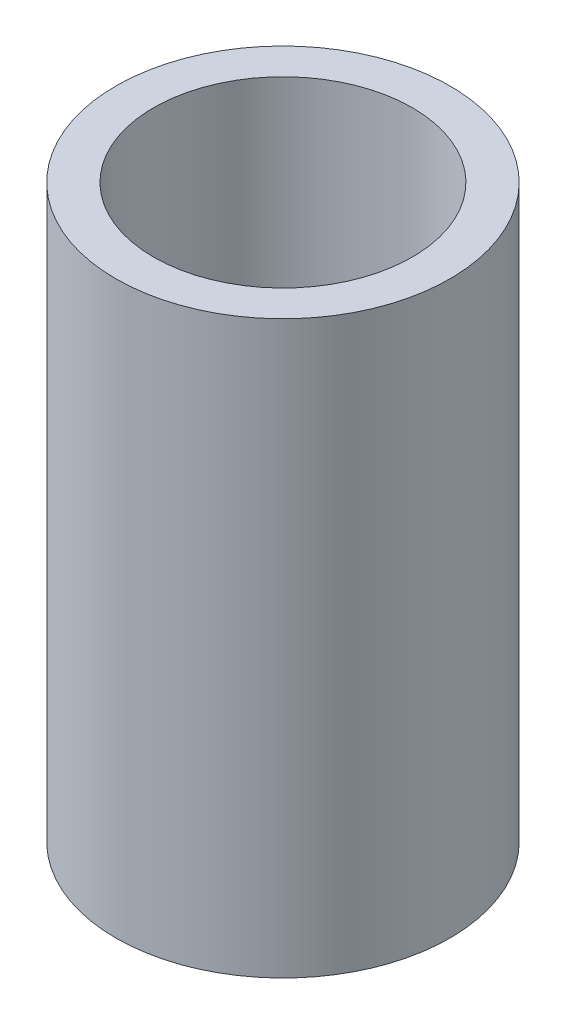
ISO-10303-21;
HEADER;
FILE_DESCRIPTION(('STEP AP214'),'2;1');
FILE_NAME('part.step','',(''),(''),'','','');
FILE_SCHEMA(('AUTOMOTIVE_DESIGN { 1 0 10303 214 1 1 1 1 }'));
ENDSEC;
DATA;
#1=APPLICATION_CONTEXT('core data for automotive mechanical design processes');
#2=APPLICATION_PROTOCOL_DEFINITION('international standard','automotive_design',2000,#1);
#3=PRODUCT_CONTEXT('',#1,'mechanical');
#4=PRODUCT('Part','Part','',(#3));
#5=PRODUCT_RELATED_PRODUCT_CATEGORY('part','',(#4));
#6=PRODUCT_DEFINITION_FORMATION('','',#4);
#7=PRODUCT_DEFINITION_CONTEXT('part definition',#1,'design');
#8=PRODUCT_DEFINITION('design','',#6,#7);
#9=PRODUCT_DEFINITION_SHAPE('','',#8);
#10=(LENGTH_UNIT() NAMED_UNIT(*) SI_UNIT(.MILLI.,.METRE.));
#11=(NAMED_UNIT(*) PLANE_ANGLE_UNIT() SI_UNIT($,.RADIAN.));
#12=(NAMED_UNIT(*) SI_UNIT($,.STERADIAN.) SOLID_ANGLE_UNIT());
#13=UNCERTAINTY_MEASURE_WITH_UNIT(LENGTH_MEASURE(1.E-05),#10,'distance_accuracy_value','');
#14=(GEOMETRIC_REPRESENTATION_CONTEXT(3) GLOBAL_UNCERTAINTY_ASSIGNED_CONTEXT((#13)) GLOBAL_UNIT_ASSIGNED_CONTEXT((#10,
#11,#12)) REPRESENTATION_CONTEXT('',''));
#15=CARTESIAN_POINT('',(0.,0.,0.));
#16=DIRECTION('',(0.,0.,1.));
#17=DIRECTION('',(1.,0.,0.));
#18=AXIS2_PLACEMENT_3D('',#15,#16,#17);
#19=CARTESIAN_POINT('',(0.,59.8108292334713,0.));
#20=DIRECTION('',(0.,-1.,0.));
#21=DIRECTION('',(0.,0.,-1.));
#22=AXIS2_PLACEMENT_3D('',#19,#20,#21);
#23=CYLINDRICAL_SURFACE('',#22,17.5);
#24=CARTESIAN_POINT('',(0.,59.8108292334713,0.));
#25=DIRECTION('',(0.,1.,0.));
#26=DIRECTION('',(0.,0.,1.));
#27=AXIS2_PLACEMENT_3D('',#24,#25,#26);
#28=CIRCLE('',#27,17.5);
#29=CARTESIAN_POINT('',(0.,59.8108292334713,17.5));
#30=VERTEX_POINT('',#29);
#31=EDGE_CURVE('E10',#30,#30,#28,.T.);
#32=ORIENTED_EDGE('',*,*,#31,.F.);
#33=EDGE_LOOP('',(#32));
#34=FACE_BOUND('',#33,.T.);
#35=CARTESIAN_POINT('',(0.,0.,0.));
#36=DIRECTION('',(0.,1.,0.));
#37=DIRECTION('',(0.,0.,1.));
#38=AXIS2_PLACEMENT_3D('',#35,#36,#37);
#39=CIRCLE('',#38,17.5);
#40=CARTESIAN_POINT('',(0.,0.,17.5));
#41=VERTEX_POINT('',#40);
#42=EDGE_CURVE('E37',#41,#41,#39,.T.);
#43=ORIENTED_EDGE('',*,*,#42,.T.);
#44=EDGE_LOOP('',(#43));
#45=FACE_BOUND('',#44,.T.);
#46=ADVANCED_FACE('F40',(#34,#45),#23,.T.);
#47=CARTESIAN_POINT('',(0.,59.8108292334713,0.));
#48=DIRECTION('',(0.,1.,0.));
#49=DIRECTION('',(0.,0.,1.));
#50=AXIS2_PLACEMENT_3D('',#47,#48,#49);
#51=PLANE('',#50);
#52=CARTESIAN_POINT('',(0.,59.8108292334713,0.));
#53=DIRECTION('',(0.,1.,0.));
#54=DIRECTION('',(0.,0.,1.));
#55=AXIS2_PLACEMENT_3D('',#52,#53,#54);
#56=CIRCLE('',#55,13.5562096785143);
#57=CARTESIAN_POINT('',(0.,59.8108292334713,13.5562096785143));
#58=VERTEX_POINT('',#57);
#59=EDGE_CURVE('E50',#58,#58,#56,.T.);
#60=ORIENTED_EDGE('',*,*,#59,.F.);
#61=EDGE_LOOP('',(#60));
#62=FACE_BOUND('',#61,.T.);
#63=ORIENTED_EDGE('',*,*,#31,.T.);
#64=EDGE_LOOP('',(#63));
#65=FACE_BOUND('',#64,.T.);
#66=ADVANCED_FACE('F59',(#62,#65),#51,.T.);
#67=CARTESIAN_POINT('',(0.,0.,0.));
#68=DIRECTION('',(0.,1.,0.));
#69=DIRECTION('',(0.,0.,1.));
#70=AXIS2_PLACEMENT_3D('',#67,#68,#69);
#71=PLANE('',#70);
#72=CARTESIAN_POINT('',(0.,0.,0.));
#73=DIRECTION('',(0.,1.,0.));
#74=DIRECTION('',(0.,0.,1.));
#75=AXIS2_PLACEMENT_3D('',#72,#73,#74);
#76=CIRCLE('',#75,13.5562096785143);
#77=CARTESIAN_POINT('',(0.,0.,13.5562096785143));
#78=VERTEX_POINT('',#77);
#79=EDGE_CURVE('E47',#78,#78,#76,.T.);
#80=ORIENTED_EDGE('',*,*,#79,.T.);
#81=EDGE_LOOP('',(#80));
#82=FACE_BOUND('',#81,.T.);
#83=ORIENTED_EDGE('',*,*,#42,.F.);
#84=EDGE_LOOP('',(#83));
#85=FACE_BOUND('',#84,.T.);
#86=ADVANCED_FACE('F58',(#82,#85),#71,.F.);
#87=CARTESIAN_POINT('',(0.,59.8108292334713,0.));
#88=DIRECTION('',(0.,-1.,0.));
#89=DIRECTION('',(0.,0.,-1.));
#90=AXIS2_PLACEMENT_3D('',#87,#88,#89);
#91=CYLINDRICAL_SURFACE('',#90,13.5562096785143);
#92=ORIENTED_EDGE('',*,*,#59,.T.);
#93=EDGE_LOOP('',(#92));
#94=FACE_BOUND('',#93,.T.);
#95=ORIENTED_EDGE('',*,*,#79,.F.);
#96=EDGE_LOOP('',(#95));
#97=FACE_BOUND('',#96,.T.);
#98=ADVANCED_FACE('F54',(#94,#97),#91,.F.);
#99=CLOSED_SHELL('',(#46,#66,#86,#98));
#100=MANIFOLD_SOLID_BREP('B2',#99);
#101=ADVANCED_BREP_SHAPE_REPRESENTATION('',(#18,#100),#14);
#102=SHAPE_DEFINITION_REPRESENTATION(#9,#101);
ENDSEC;
END-ISO-10303-21;
